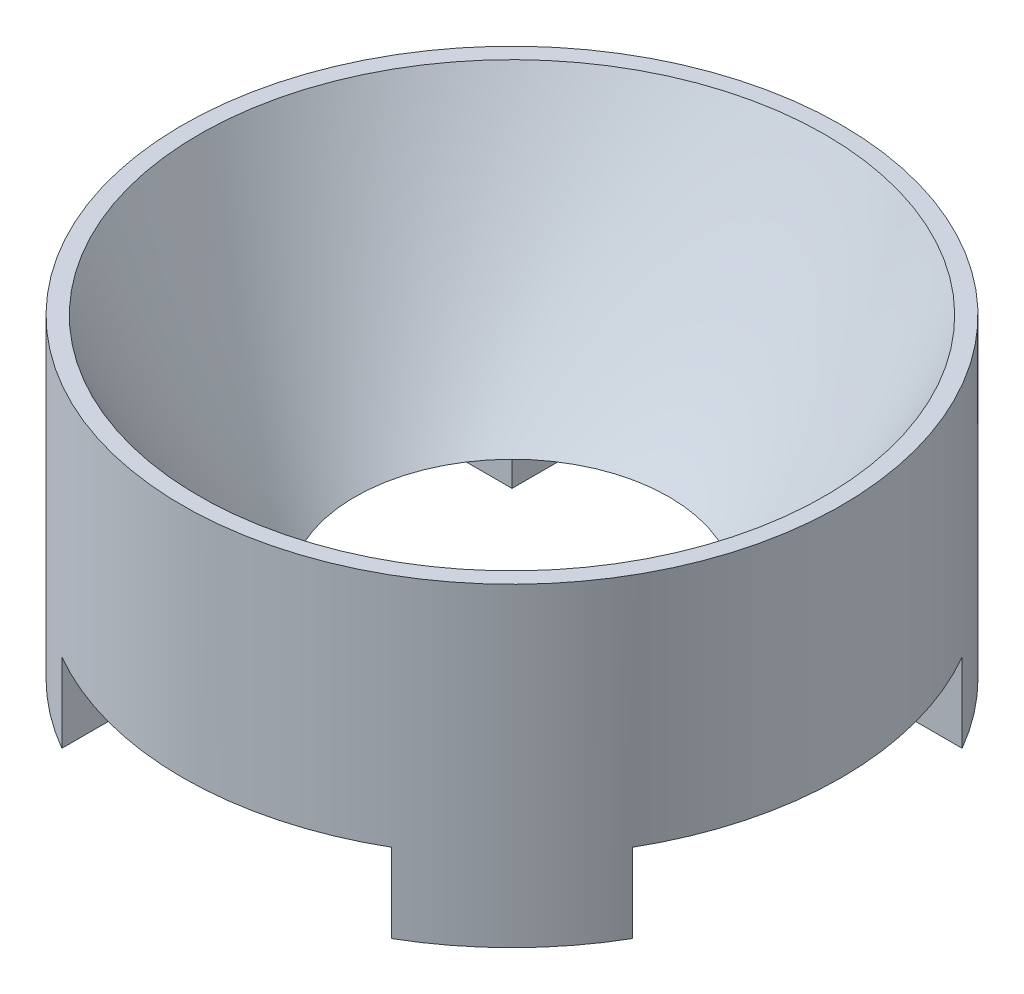
ISO-10303-21;
HEADER;
FILE_DESCRIPTION(('STEP AP214'),'2;1');
FILE_NAME('part.step','',(''),(''),'','','');
FILE_SCHEMA(('AUTOMOTIVE_DESIGN { 1 0 10303 214 1 1 1 1 }'));
ENDSEC;
DATA;
#1=APPLICATION_CONTEXT('core data for automotive mechanical design processes');
#2=APPLICATION_PROTOCOL_DEFINITION('international standard','automotive_design',2000,#1);
#3=PRODUCT_CONTEXT('',#1,'mechanical');
#4=PRODUCT('Part','Part','',(#3));
#5=PRODUCT_RELATED_PRODUCT_CATEGORY('part','',(#4));
#6=PRODUCT_DEFINITION_FORMATION('','',#4);
#7=PRODUCT_DEFINITION_CONTEXT('part definition',#1,'design');
#8=PRODUCT_DEFINITION('design','',#6,#7);
#9=PRODUCT_DEFINITION_SHAPE('','',#8);
#10=(LENGTH_UNIT() NAMED_UNIT(*) SI_UNIT(.MILLI.,.METRE.));
#11=(NAMED_UNIT(*) PLANE_ANGLE_UNIT() SI_UNIT($,.RADIAN.));
#12=(NAMED_UNIT(*) SI_UNIT($,.STERADIAN.) SOLID_ANGLE_UNIT());
#13=UNCERTAINTY_MEASURE_WITH_UNIT(LENGTH_MEASURE(1.E-05),#10,'distance_accuracy_value','');
#14=(GEOMETRIC_REPRESENTATION_CONTEXT(3) GLOBAL_UNCERTAINTY_ASSIGNED_CONTEXT((#13)) GLOBAL_UNIT_ASSIGNED_CONTEXT((#10,
#11,#12)) REPRESENTATION_CONTEXT('',''));
#15=CARTESIAN_POINT('',(0.,0.,0.));
#16=DIRECTION('',(0.,0.,1.));
#17=DIRECTION('',(1.,0.,0.));
#18=AXIS2_PLACEMENT_3D('',#15,#16,#17);
#19=CARTESIAN_POINT('',(3.,0.,0.));
#20=DIRECTION('',(0.,-1.,0.));
#21=DIRECTION('',(0.,0.,-1.));
#22=AXIS2_PLACEMENT_3D('',#19,#20,#21);
#23=PLANE('',#22);
#24=DIRECTION('',(0.,0.,-1.));
#25=VECTOR('',#24,1.);
#26=CARTESIAN_POINT('',(-3.175,0.,-3.175));
#27=LINE('',#26,#25);
#28=CARTESIAN_POINT('',(-3.175,0.,-3.175));
#29=VERTEX_POINT('',#28);
#30=CARTESIAN_POINT('',(-3.175,0.,-5.49926131403118));
#31=VERTEX_POINT('',#30);
#32=EDGE_CURVE('E139',#29,#31,#27,.T.);
#33=ORIENTED_EDGE('',*,*,#32,.F.);
#34=DIRECTION('',(1.,0.,0.));
#35=VECTOR('',#34,1.);
#36=CARTESIAN_POINT('',(-13.6828233529994,0.,-3.175));
#37=LINE('',#36,#35);
#38=CARTESIAN_POINT('',(-5.49926131403119,0.,-3.175));
#39=VERTEX_POINT('',#38);
#40=EDGE_CURVE('E176',#39,#29,#37,.T.);
#41=ORIENTED_EDGE('',*,*,#40,.F.);
#42=CARTESIAN_POINT('',(0.,0.,0.));
#43=DIRECTION('',(0.,-1.,0.));
#44=DIRECTION('',(0.,0.,-1.));
#45=AXIS2_PLACEMENT_3D('',#42,#43,#44);
#46=CIRCLE('',#45,6.35);
#47=EDGE_CURVE('E191',#39,#31,#46,.T.);
#48=ORIENTED_EDGE('',*,*,#47,.T.);
#49=EDGE_LOOP('',(#33,#41,#48));
#50=FACE_BOUND('',#49,.T.);
#51=ADVANCED_FACE('F43',(#50),#23,.T.);
#52=DIRECTION('',(-1.,0.,0.));
#53=VECTOR('',#52,1.);
#54=CARTESIAN_POINT('',(-13.6828233529994,0.,3.175));
#55=LINE('',#54,#53);
#56=CARTESIAN_POINT('',(-3.175,0.,3.17499999999997));
#57=VERTEX_POINT('',#56);
#58=CARTESIAN_POINT('',(-5.4992613140312,0.,3.17499999999998));
#59=VERTEX_POINT('',#58);
#60=EDGE_CURVE('E174',#57,#59,#55,.T.);
#61=ORIENTED_EDGE('',*,*,#60,.F.);
#62=DIRECTION('',(0.,0.,-1.));
#63=VECTOR('',#62,1.);
#64=CARTESIAN_POINT('',(-3.175,0.,13.6828233529994));
#65=LINE('',#64,#63);
#66=CARTESIAN_POINT('',(-3.175,0.,5.49926131403118));
#67=VERTEX_POINT('',#66);
#68=EDGE_CURVE('E172',#67,#57,#65,.T.);
#69=ORIENTED_EDGE('',*,*,#68,.F.);
#70=EDGE_CURVE('E301',#67,#59,#46,.T.);
#71=ORIENTED_EDGE('',*,*,#70,.T.);
#72=EDGE_LOOP('',(#61,#69,#71));
#73=FACE_BOUND('',#72,.T.);
#74=ADVANCED_FACE('F247',(#73),#23,.T.);
#75=DIRECTION('',(0.,0.,1.));
#76=VECTOR('',#75,1.);
#77=CARTESIAN_POINT('',(3.175,0.,13.6828233529994));
#78=LINE('',#77,#76);
#79=CARTESIAN_POINT('',(3.175,0.,3.17499999999997));
#80=VERTEX_POINT('',#79);
#81=CARTESIAN_POINT('',(3.175,0.,5.49926131403119));
#82=VERTEX_POINT('',#81);
#83=EDGE_CURVE('E170',#80,#82,#78,.T.);
#84=ORIENTED_EDGE('',*,*,#83,.F.);
#85=DIRECTION('',(-1.,0.,0.));
#86=VECTOR('',#85,1.);
#87=CARTESIAN_POINT('',(3.175,0.,3.17499999999997));
#88=LINE('',#87,#86);
#89=CARTESIAN_POINT('',(5.4992613140312,0.,3.17499999999998));
#90=VERTEX_POINT('',#89);
#91=EDGE_CURVE('E168',#90,#80,#88,.T.);
#92=ORIENTED_EDGE('',*,*,#91,.F.);
#93=EDGE_CURVE('E266',#90,#82,#46,.T.);
#94=ORIENTED_EDGE('',*,*,#93,.T.);
#95=EDGE_LOOP('',(#84,#92,#94));
#96=FACE_BOUND('',#95,.T.);
#97=ADVANCED_FACE('F203',(#96),#23,.T.);
#98=CARTESIAN_POINT('',(6.03256665046776,6.06531192541828,0.));
#99=CARTESIAN_POINT('',(4.51628332524095,3.01628425024194,0.));
#100=CARTESIAN_POINT('',(3.00000000001415,1.50000046001429,0.));
#101=B_SPLINE_CURVE_WITH_KNOTS('',2,(#98,#99,#100),.UNSPECIFIED.,.F.,.F.,(3,3),
(0.18954182919627,0.293296022352428),.UNSPECIFIED.);
#102=CARTESIAN_POINT('',(0.,-656.29921259787,0.));
#103=DIRECTION('',(0.,-1.,0.));
#104=AXIS1_PLACEMENT('',#102,#103);
#105=SURFACE_OF_REVOLUTION('',#101,#104);
#106=CARTESIAN_POINT('',(0.,6.06531192541826,0.));
#107=DIRECTION('',(0.,-1.,0.));
#108=DIRECTION('',(0.,0.,-1.));
#109=AXIS2_PLACEMENT_3D('',#106,#107,#108);
#110=CIRCLE('',#109,6.03256665046776);
#111=CARTESIAN_POINT('',(0.,6.06531192541826,-6.03256665046776));
#112=VERTEX_POINT('',#111);
#113=EDGE_CURVE('E292',#112,#112,#110,.T.);
#114=ORIENTED_EDGE('',*,*,#113,.F.);
#115=EDGE_LOOP('',(#114));
#116=FACE_BOUND('',#115,.T.);
#117=CARTESIAN_POINT('',(0.,1.52399999999997,0.));
#118=DIRECTION('',(0.,-1.,0.));
#119=DIRECTION('',(0.,0.,-1.));
#120=AXIS2_PLACEMENT_3D('',#117,#118,#119);
#121=CIRCLE('',#120,3.02390429673956);
#122=CARTESIAN_POINT('',(0.,1.52399999999997,-3.02390429673956));
#123=VERTEX_POINT('',#122);
#124=EDGE_CURVE('E182',#123,#123,#121,.T.);
#125=ORIENTED_EDGE('',*,*,#124,.T.);
#126=EDGE_LOOP('',(#125));
#127=FACE_BOUND('',#126,.T.);
#128=ADVANCED_FACE('F200',(#116,#127),#105,.F.);
#129=DIRECTION('',(0.,0.,1.));
#130=VECTOR('',#129,1.);
#131=CARTESIAN_POINT('',(3.175,0.,-3.175));
#132=LINE('',#131,#130);
#133=CARTESIAN_POINT('',(3.175,0.,-5.49926131403118));
#134=VERTEX_POINT('',#133);
#135=CARTESIAN_POINT('',(3.175,0.,-3.175));
#136=VERTEX_POINT('',#135);
#137=EDGE_CURVE('E145',#134,#136,#132,.T.);
#138=ORIENTED_EDGE('',*,*,#137,.F.);
#139=CARTESIAN_POINT('',(5.49926131403119,0.,-3.175));
#140=VERTEX_POINT('',#139);
#141=EDGE_CURVE('E196',#134,#140,#46,.T.);
#142=ORIENTED_EDGE('',*,*,#141,.T.);
#143=DIRECTION('',(1.,0.,0.));
#144=VECTOR('',#143,1.);
#145=CARTESIAN_POINT('',(3.175,0.,-3.175));
#146=LINE('',#145,#144);
#147=EDGE_CURVE('E166',#136,#140,#146,.T.);
#148=ORIENTED_EDGE('',*,*,#147,.F.);
#149=EDGE_LOOP('',(#138,#142,#148));
#150=FACE_BOUND('',#149,.T.);
#151=ADVANCED_FACE('F45',(#150),#23,.T.);
#152=CARTESIAN_POINT('',(6.03256665046692,6.06531192541745,0.));
#153=DIRECTION('',(0.,1.,0.));
#154=DIRECTION('',(0.,0.,1.));
#155=AXIS2_PLACEMENT_3D('',#152,#153,#154);
#156=PLANE('',#155);
#157=ORIENTED_EDGE('',*,*,#113,.T.);
#158=EDGE_LOOP('',(#157));
#159=FACE_BOUND('',#158,.T.);
#160=CARTESIAN_POINT('',(0.,6.06531192541659,0.));
#161=DIRECTION('',(0.,-1.,0.));
#162=DIRECTION('',(0.,0.,-1.));
#163=AXIS2_PLACEMENT_3D('',#160,#161,#162);
#164=CIRCLE('',#163,6.35);
#165=CARTESIAN_POINT('',(0.,6.06531192541659,-6.35));
#166=VERTEX_POINT('',#165);
#167=EDGE_CURVE('E296',#166,#166,#164,.T.);
#168=ORIENTED_EDGE('',*,*,#167,.F.);
#169=EDGE_LOOP('',(#168));
#170=FACE_BOUND('',#169,.T.);
#171=ADVANCED_FACE('F205',(#159,#170),#156,.T.);
#172=CARTESIAN_POINT('',(0.,-656.29921259787,0.));
#173=DIRECTION('',(0.,-1.,0.));
#174=DIRECTION('',(0.,0.,-1.));
#175=AXIS2_PLACEMENT_3D('',#172,#173,#174);
#176=CYLINDRICAL_SURFACE('',#175,6.35);
#177=DIRECTION('',(0.,-1.,0.));
#178=VECTOR('',#177,1.);
#179=CARTESIAN_POINT('',(-5.49926131403119,-656.29921259787,-3.175));
#180=LINE('',#179,#178);
#181=CARTESIAN_POINT('',(-5.49926131403119,1.52399999999997,-3.175));
#182=VERTEX_POINT('',#181);
#183=EDGE_CURVE('E12',#182,#39,#180,.T.);
#184=ORIENTED_EDGE('',*,*,#183,.F.);
#185=CARTESIAN_POINT('',(0.,1.52399999999997,0.));
#186=DIRECTION('',(0.,-1.,0.));
#187=DIRECTION('',(0.,0.,-1.));
#188=AXIS2_PLACEMENT_3D('',#185,#186,#187);
#189=CIRCLE('',#188,6.35);
#190=CARTESIAN_POINT('',(-5.4992613140312,1.52399999999997,3.17499999999998));
#191=VERTEX_POINT('',#190);
#192=EDGE_CURVE('E279',#182,#191,#189,.F.);
#193=ORIENTED_EDGE('',*,*,#192,.T.);
#194=DIRECTION('',(0.,-1.,0.));
#195=VECTOR('',#194,1.);
#196=CARTESIAN_POINT('',(-5.4992613140312,-656.29921259787,3.17499999999998));
#197=LINE('',#196,#195);
#198=EDGE_CURVE('E51',#59,#191,#197,.F.);
#199=ORIENTED_EDGE('',*,*,#198,.F.);
#200=ORIENTED_EDGE('',*,*,#70,.F.);
#201=DIRECTION('',(0.,-1.,0.));
#202=VECTOR('',#201,1.);
#203=CARTESIAN_POINT('',(-3.175,-656.29921259787,5.49926131403118));
#204=LINE('',#203,#202);
#205=CARTESIAN_POINT('',(-3.175,1.52399999999997,5.49926131403118));
#206=VERTEX_POINT('',#205);
#207=EDGE_CURVE('E277',#206,#67,#204,.T.);
#208=ORIENTED_EDGE('',*,*,#207,.F.);
#209=CARTESIAN_POINT('',(3.175,1.52399999999997,5.49926131403119));
#210=VERTEX_POINT('',#209);
#211=EDGE_CURVE('E276',#206,#210,#189,.F.);
#212=ORIENTED_EDGE('',*,*,#211,.T.);
#213=DIRECTION('',(0.,-1.,0.));
#214=VECTOR('',#213,1.);
#215=CARTESIAN_POINT('',(3.175,-656.29921259787,5.49926131403118));
#216=LINE('',#215,#214);
#217=EDGE_CURVE('E269',#82,#210,#216,.F.);
#218=ORIENTED_EDGE('',*,*,#217,.F.);
#219=ORIENTED_EDGE('',*,*,#93,.F.);
#220=DIRECTION('',(0.,-1.,0.));
#221=VECTOR('',#220,1.);
#222=CARTESIAN_POINT('',(5.4992613140312,-656.29921259787,3.17499999999998));
#223=LINE('',#222,#221);
#224=CARTESIAN_POINT('',(5.4992613140312,1.52399999999997,3.17499999999998));
#225=VERTEX_POINT('',#224);
#226=EDGE_CURVE('E281',#225,#90,#223,.T.);
#227=ORIENTED_EDGE('',*,*,#226,.F.);
#228=CARTESIAN_POINT('',(5.49926131403119,1.52399999999997,-3.175));
#229=VERTEX_POINT('',#228);
#230=EDGE_CURVE('E283',#225,#229,#189,.F.);
#231=ORIENTED_EDGE('',*,*,#230,.T.);
#232=DIRECTION('',(0.,-1.,0.));
#233=VECTOR('',#232,1.);
#234=CARTESIAN_POINT('',(5.49926131403119,-656.29921259787,-3.175));
#235=LINE('',#234,#233);
#236=EDGE_CURVE('E66',#140,#229,#235,.F.);
#237=ORIENTED_EDGE('',*,*,#236,.F.);
#238=ORIENTED_EDGE('',*,*,#141,.F.);
#239=DIRECTION('',(0.,-1.,0.));
#240=VECTOR('',#239,1.);
#241=CARTESIAN_POINT('',(3.175,-656.29921259787,-5.49926131403118));
#242=LINE('',#241,#240);
#243=CARTESIAN_POINT('',(3.175,1.52399999999997,-5.49926131403118));
#244=VERTEX_POINT('',#243);
#245=EDGE_CURVE('E294',#244,#134,#242,.T.);
#246=ORIENTED_EDGE('',*,*,#245,.F.);
#247=CARTESIAN_POINT('',(-3.175,1.52399999999997,-5.49926131403118));
#248=VERTEX_POINT('',#247);
#249=EDGE_CURVE('E136',#244,#248,#189,.F.);
#250=ORIENTED_EDGE('',*,*,#249,.T.);
#251=DIRECTION('',(0.,-1.,0.));
#252=VECTOR('',#251,1.);
#253=CARTESIAN_POINT('',(-3.175,-656.29921259787,-5.49926131403118));
#254=LINE('',#253,#252);
#255=EDGE_CURVE('E291',#31,#248,#254,.F.);
#256=ORIENTED_EDGE('',*,*,#255,.F.);
#257=ORIENTED_EDGE('',*,*,#47,.F.);
#258=EDGE_LOOP('',(#184,#193,#199,#200,#208,#212,#218,#219,#227,#231,#237,#238,#246,#250,#256,#257));
#259=FACE_BOUND('',#258,.T.);
#260=ORIENTED_EDGE('',*,*,#167,.T.);
#261=EDGE_LOOP('',(#260));
#262=FACE_BOUND('',#261,.T.);
#263=ADVANCED_FACE('F208',(#259,#262),#176,.T.);
#264=CARTESIAN_POINT('',(3.175,1.524,-3.175));
#265=DIRECTION('',(1.,0.,0.));
#266=DIRECTION('',(0.,0.,-1.));
#267=AXIS2_PLACEMENT_3D('',#264,#265,#266);
#268=PLANE('',#267);
#269=ORIENTED_EDGE('',*,*,#245,.T.);
#270=ORIENTED_EDGE('',*,*,#137,.T.);
#271=DIRECTION('',(0.,-1.,0.));
#272=VECTOR('',#271,1.);
#273=CARTESIAN_POINT('',(3.175,1.524,-3.175));
#274=LINE('',#273,#272);
#275=CARTESIAN_POINT('',(3.175,1.524,-3.175));
#276=VERTEX_POINT('',#275);
#277=EDGE_CURVE('E142',#276,#136,#274,.T.);
#278=ORIENTED_EDGE('',*,*,#277,.F.);
#279=DIRECTION('',(0.,0.,1.));
#280=VECTOR('',#279,1.);
#281=CARTESIAN_POINT('',(3.175,1.524,-3.175));
#282=LINE('',#281,#280);
#283=EDGE_CURVE('E130',#244,#276,#282,.T.);
#284=ORIENTED_EDGE('',*,*,#283,.F.);
#285=EDGE_LOOP('',(#269,#270,#278,#284));
#286=FACE_BOUND('',#285,.T.);
#287=ADVANCED_FACE('F143',(#286),#268,.F.);
#288=CARTESIAN_POINT('',(-3.175,1.524,-3.175));
#289=DIRECTION('',(-1.,0.,0.));
#290=DIRECTION('',(0.,0.,1.));
#291=AXIS2_PLACEMENT_3D('',#288,#289,#290);
#292=PLANE('',#291);
#293=ORIENTED_EDGE('',*,*,#255,.T.);
#294=DIRECTION('',(0.,0.,-1.));
#295=VECTOR('',#294,1.);
#296=CARTESIAN_POINT('',(-3.175,1.524,-3.175));
#297=LINE('',#296,#295);
#298=CARTESIAN_POINT('',(-3.175,1.524,-3.175));
#299=VERTEX_POINT('',#298);
#300=EDGE_CURVE('E58',#299,#248,#297,.T.);
#301=ORIENTED_EDGE('',*,*,#300,.F.);
#302=DIRECTION('',(0.,-1.,0.));
#303=VECTOR('',#302,1.);
#304=CARTESIAN_POINT('',(-3.175,1.524,-3.175));
#305=LINE('',#304,#303);
#306=EDGE_CURVE('E179',#299,#29,#305,.T.);
#307=ORIENTED_EDGE('',*,*,#306,.T.);
#308=ORIENTED_EDGE('',*,*,#32,.T.);
#309=EDGE_LOOP('',(#293,#301,#307,#308));
#310=FACE_BOUND('',#309,.T.);
#311=ADVANCED_FACE('F215',(#310),#292,.F.);
#312=CARTESIAN_POINT('',(-13.6828233529994,1.524,-3.175));
#313=DIRECTION('',(0.,0.,-1.));
#314=DIRECTION('',(-1.,0.,0.));
#315=AXIS2_PLACEMENT_3D('',#312,#313,#314);
#316=PLANE('',#315);
#317=ORIENTED_EDGE('',*,*,#183,.T.);
#318=ORIENTED_EDGE('',*,*,#40,.T.);
#319=ORIENTED_EDGE('',*,*,#306,.F.);
#320=DIRECTION('',(1.,0.,0.));
#321=VECTOR('',#320,1.);
#322=CARTESIAN_POINT('',(-13.6828233529994,1.524,-3.175));
#323=LINE('',#322,#321);
#324=EDGE_CURVE('E162',#182,#299,#323,.T.);
#325=ORIENTED_EDGE('',*,*,#324,.F.);
#326=EDGE_LOOP('',(#317,#318,#319,#325));
#327=FACE_BOUND('',#326,.T.);
#328=ADVANCED_FACE('F233',(#327),#316,.F.);
#329=CARTESIAN_POINT('',(-13.6828233529994,1.524,3.175));
#330=DIRECTION('',(0.,0.,1.));
#331=DIRECTION('',(1.,0.,0.));
#332=AXIS2_PLACEMENT_3D('',#329,#330,#331);
#333=PLANE('',#332);
#334=ORIENTED_EDGE('',*,*,#198,.T.);
#335=DIRECTION('',(-1.,0.,0.));
#336=VECTOR('',#335,1.);
#337=CARTESIAN_POINT('',(-13.6828233529994,1.524,3.175));
#338=LINE('',#337,#336);
#339=CARTESIAN_POINT('',(-3.175,1.524,3.17499999999997));
#340=VERTEX_POINT('',#339);
#341=EDGE_CURVE('E159',#340,#191,#338,.T.);
#342=ORIENTED_EDGE('',*,*,#341,.F.);
#343=DIRECTION('',(0.,-1.,0.));
#344=VECTOR('',#343,1.);
#345=CARTESIAN_POINT('',(-3.175,1.524,3.17499999999997));
#346=LINE('',#345,#344);
#347=EDGE_CURVE('E183',#340,#57,#346,.T.);
#348=ORIENTED_EDGE('',*,*,#347,.T.);
#349=ORIENTED_EDGE('',*,*,#60,.T.);
#350=EDGE_LOOP('',(#334,#342,#348,#349));
#351=FACE_BOUND('',#350,.T.);
#352=ADVANCED_FACE('F229',(#351),#333,.F.);
#353=CARTESIAN_POINT('',(-3.175,1.524,13.6828233529994));
#354=DIRECTION('',(-1.,0.,0.));
#355=DIRECTION('',(0.,0.,1.));
#356=AXIS2_PLACEMENT_3D('',#353,#354,#355);
#357=PLANE('',#356);
#358=ORIENTED_EDGE('',*,*,#207,.T.);
#359=ORIENTED_EDGE('',*,*,#68,.T.);
#360=ORIENTED_EDGE('',*,*,#347,.F.);
#361=DIRECTION('',(0.,0.,-1.));
#362=VECTOR('',#361,1.);
#363=CARTESIAN_POINT('',(-3.175,1.524,13.6828233529994));
#364=LINE('',#363,#362);
#365=EDGE_CURVE('E157',#206,#340,#364,.T.);
#366=ORIENTED_EDGE('',*,*,#365,.F.);
#367=EDGE_LOOP('',(#358,#359,#360,#366));
#368=FACE_BOUND('',#367,.T.);
#369=ADVANCED_FACE('F225',(#368),#357,.F.);
#370=CARTESIAN_POINT('',(3.175,1.524,13.6828233529994));
#371=DIRECTION('',(1.,0.,0.));
#372=DIRECTION('',(0.,0.,-1.));
#373=AXIS2_PLACEMENT_3D('',#370,#371,#372);
#374=PLANE('',#373);
#375=ORIENTED_EDGE('',*,*,#217,.T.);
#376=DIRECTION('',(0.,0.,1.));
#377=VECTOR('',#376,1.);
#378=CARTESIAN_POINT('',(3.175,1.524,13.6828233529994));
#379=LINE('',#378,#377);
#380=CARTESIAN_POINT('',(3.175,1.524,3.17499999999997));
#381=VERTEX_POINT('',#380);
#382=EDGE_CURVE('E152',#381,#210,#379,.T.);
#383=ORIENTED_EDGE('',*,*,#382,.F.);
#384=DIRECTION('',(0.,-1.,0.));
#385=VECTOR('',#384,1.);
#386=CARTESIAN_POINT('',(3.175,1.524,3.17499999999997));
#387=LINE('',#386,#385);
#388=EDGE_CURVE('E147',#381,#80,#387,.T.);
#389=ORIENTED_EDGE('',*,*,#388,.T.);
#390=ORIENTED_EDGE('',*,*,#83,.T.);
#391=EDGE_LOOP('',(#375,#383,#389,#390));
#392=FACE_BOUND('',#391,.T.);
#393=ADVANCED_FACE('F221',(#392),#374,.F.);
#394=CARTESIAN_POINT('',(3.175,1.524,3.17499999999997));
#395=DIRECTION('',(0.,0.,1.));
#396=DIRECTION('',(1.,0.,0.));
#397=AXIS2_PLACEMENT_3D('',#394,#395,#396);
#398=PLANE('',#397);
#399=ORIENTED_EDGE('',*,*,#226,.T.);
#400=ORIENTED_EDGE('',*,*,#91,.T.);
#401=ORIENTED_EDGE('',*,*,#388,.F.);
#402=DIRECTION('',(-1.,0.,0.));
#403=VECTOR('',#402,1.);
#404=CARTESIAN_POINT('',(3.175,1.524,3.17499999999997));
#405=LINE('',#404,#403);
#406=EDGE_CURVE('E150',#225,#381,#405,.T.);
#407=ORIENTED_EDGE('',*,*,#406,.F.);
#408=EDGE_LOOP('',(#399,#400,#401,#407));
#409=FACE_BOUND('',#408,.T.);
#410=ADVANCED_FACE('F218',(#409),#398,.F.);
#411=CARTESIAN_POINT('',(3.175,1.524,-3.175));
#412=DIRECTION('',(0.,0.,-1.));
#413=DIRECTION('',(-1.,0.,0.));
#414=AXIS2_PLACEMENT_3D('',#411,#412,#413);
#415=PLANE('',#414);
#416=ORIENTED_EDGE('',*,*,#236,.T.);
#417=DIRECTION('',(1.,0.,0.));
#418=VECTOR('',#417,1.);
#419=CARTESIAN_POINT('',(3.175,1.524,-3.175));
#420=LINE('',#419,#418);
#421=EDGE_CURVE('E133',#276,#229,#420,.T.);
#422=ORIENTED_EDGE('',*,*,#421,.F.);
#423=ORIENTED_EDGE('',*,*,#277,.T.);
#424=ORIENTED_EDGE('',*,*,#147,.T.);
#425=EDGE_LOOP('',(#416,#422,#423,#424));
#426=FACE_BOUND('',#425,.T.);
#427=ADVANCED_FACE('F149',(#426),#415,.F.);
#428=CARTESIAN_POINT('',(0.,1.524,0.));
#429=DIRECTION('',(0.,-1.,0.));
#430=DIRECTION('',(0.,0.,-1.));
#431=AXIS2_PLACEMENT_3D('',#428,#429,#430);
#432=PLANE('',#431);
#433=ORIENTED_EDGE('',*,*,#124,.F.);
#434=EDGE_LOOP('',(#433));
#435=FACE_BOUND('',#434,.T.);
#436=ORIENTED_EDGE('',*,*,#324,.T.);
#437=ORIENTED_EDGE('',*,*,#300,.T.);
#438=ORIENTED_EDGE('',*,*,#249,.F.);
#439=ORIENTED_EDGE('',*,*,#283,.T.);
#440=ORIENTED_EDGE('',*,*,#421,.T.);
#441=ORIENTED_EDGE('',*,*,#230,.F.);
#442=ORIENTED_EDGE('',*,*,#406,.T.);
#443=ORIENTED_EDGE('',*,*,#382,.T.);
#444=ORIENTED_EDGE('',*,*,#211,.F.);
#445=ORIENTED_EDGE('',*,*,#365,.T.);
#446=ORIENTED_EDGE('',*,*,#341,.T.);
#447=ORIENTED_EDGE('',*,*,#192,.F.);
#448=EDGE_LOOP('',(#436,#437,#438,#439,#440,#441,#442,#443,#444,#445,#446,#447));
#449=FACE_BOUND('',#448,.T.);
#450=ADVANCED_FACE('F132',(#435,#449),#432,.T.);
#451=CLOSED_SHELL('',(#51,#74,#97,#128,#151,#171,#263,#287,#311,#328,#352,#369,#393,#410,#427,#450));
#452=MANIFOLD_SOLID_BREP('B2',#451);
#453=ADVANCED_BREP_SHAPE_REPRESENTATION('',(#18,#452),#14);
#454=SHAPE_DEFINITION_REPRESENTATION(#9,#453);
ENDSEC;
END-ISO-10303-21;
